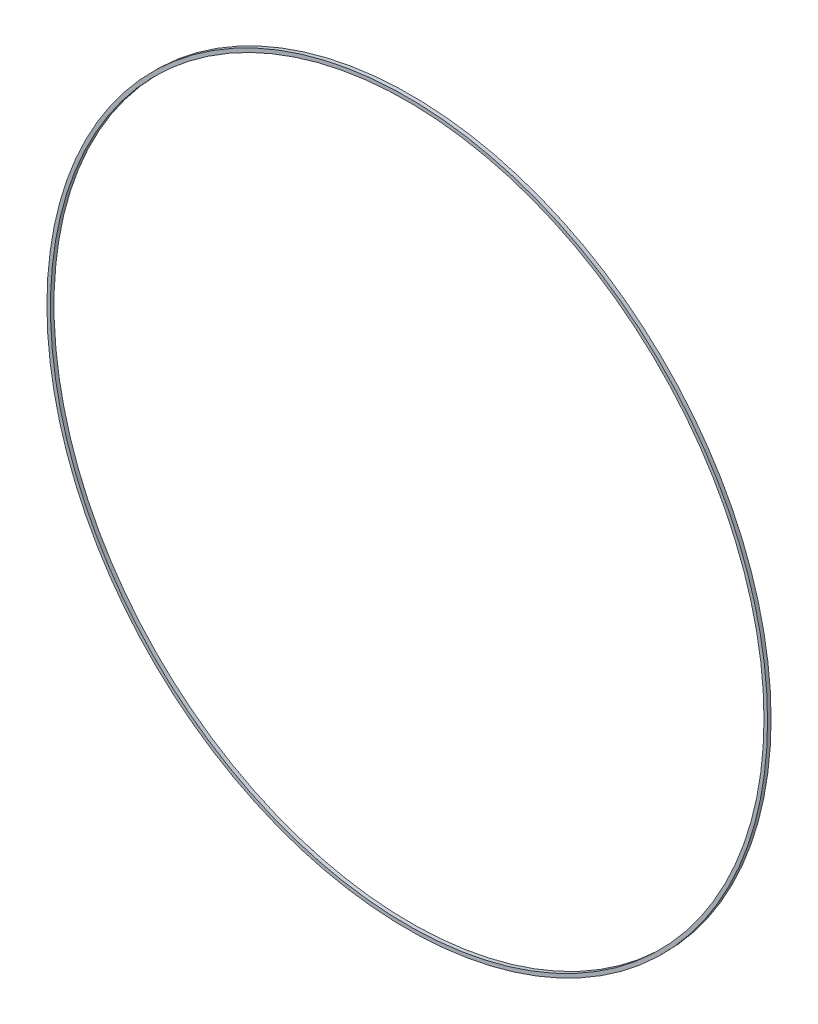
ISO-10303-21;
HEADER;
FILE_DESCRIPTION(('STEP AP214'),'2;1');
FILE_NAME('part.step','',(''),(''),'','','');
FILE_SCHEMA(('AUTOMOTIVE_DESIGN { 1 0 10303 214 1 1 1 1 }'));
ENDSEC;
DATA;
#1=APPLICATION_CONTEXT('core data for automotive mechanical design processes');
#2=APPLICATION_PROTOCOL_DEFINITION('international standard','automotive_design',2000,#1);
#3=PRODUCT_CONTEXT('',#1,'mechanical');
#4=PRODUCT('Part','Part','',(#3));
#5=PRODUCT_RELATED_PRODUCT_CATEGORY('part','',(#4));
#6=PRODUCT_DEFINITION_FORMATION('','',#4);
#7=PRODUCT_DEFINITION_CONTEXT('part definition',#1,'design');
#8=PRODUCT_DEFINITION('design','',#6,#7);
#9=PRODUCT_DEFINITION_SHAPE('','',#8);
#10=(LENGTH_UNIT() NAMED_UNIT(*) SI_UNIT(.MILLI.,.METRE.));
#11=(NAMED_UNIT(*) PLANE_ANGLE_UNIT() SI_UNIT($,.RADIAN.));
#12=(NAMED_UNIT(*) SI_UNIT($,.STERADIAN.) SOLID_ANGLE_UNIT());
#13=UNCERTAINTY_MEASURE_WITH_UNIT(LENGTH_MEASURE(1.E-05),#10,'distance_accuracy_value','');
#14=(GEOMETRIC_REPRESENTATION_CONTEXT(3) GLOBAL_UNCERTAINTY_ASSIGNED_CONTEXT((#13)) GLOBAL_UNIT_ASSIGNED_CONTEXT((#10,
#11,#12)) REPRESENTATION_CONTEXT('',''));
#15=CARTESIAN_POINT('',(0.,0.,0.));
#16=DIRECTION('',(0.,0.,1.));
#17=DIRECTION('',(1.,0.,0.));
#18=AXIS2_PLACEMENT_3D('',#15,#16,#17);
#19=CARTESIAN_POINT('',(0.,0.,2.));
#20=DIRECTION('',(0.,0.,-1.));
#21=DIRECTION('',(-1.,0.,0.));
#22=AXIS2_PLACEMENT_3D('',#19,#20,#21);
#23=CYLINDRICAL_SURFACE('',#22,203.);
#24=CARTESIAN_POINT('',(0.,0.,2.));
#25=DIRECTION('',(0.,0.,1.));
#26=DIRECTION('',(1.,0.,0.));
#27=AXIS2_PLACEMENT_3D('',#24,#25,#26);
#28=CIRCLE('',#27,203.);
#29=CARTESIAN_POINT('',(203.,0.,2.));
#30=VERTEX_POINT('',#29);
#31=EDGE_CURVE('E10',#30,#30,#28,.T.);
#32=ORIENTED_EDGE('',*,*,#31,.F.);
#33=EDGE_LOOP('',(#32));
#34=FACE_BOUND('',#33,.T.);
#35=CARTESIAN_POINT('',(0.,0.,0.));
#36=DIRECTION('',(0.,0.,1.));
#37=DIRECTION('',(1.,0.,0.));
#38=AXIS2_PLACEMENT_3D('',#35,#36,#37);
#39=CIRCLE('',#38,203.);
#40=CARTESIAN_POINT('',(203.,0.,0.));
#41=VERTEX_POINT('',#40);
#42=EDGE_CURVE('E34',#41,#41,#39,.T.);
#43=ORIENTED_EDGE('',*,*,#42,.T.);
#44=EDGE_LOOP('',(#43));
#45=FACE_BOUND('',#44,.T.);
#46=ADVANCED_FACE('F31',(#34,#45),#23,.T.);
#47=CARTESIAN_POINT('',(0.,0.,2.));
#48=DIRECTION('',(0.,0.,1.));
#49=DIRECTION('',(1.,0.,0.));
#50=AXIS2_PLACEMENT_3D('',#47,#48,#49);
#51=PLANE('',#50);
#52=CARTESIAN_POINT('',(0.,0.,2.));
#53=DIRECTION('',(0.,0.,1.));
#54=DIRECTION('',(1.,0.,0.));
#55=AXIS2_PLACEMENT_3D('',#52,#53,#54);
#56=CIRCLE('',#55,201.);
#57=CARTESIAN_POINT('',(201.,0.,2.));
#58=VERTEX_POINT('',#57);
#59=EDGE_CURVE('E43',#58,#58,#56,.T.);
#60=ORIENTED_EDGE('',*,*,#59,.F.);
#61=EDGE_LOOP('',(#60));
#62=FACE_BOUND('',#61,.T.);
#63=ORIENTED_EDGE('',*,*,#31,.T.);
#64=EDGE_LOOP('',(#63));
#65=FACE_BOUND('',#64,.T.);
#66=ADVANCED_FACE('F58',(#62,#65),#51,.T.);
#67=CARTESIAN_POINT('',(0.,0.,0.));
#68=DIRECTION('',(0.,0.,1.));
#69=DIRECTION('',(1.,0.,0.));
#70=AXIS2_PLACEMENT_3D('',#67,#68,#69);
#71=PLANE('',#70);
#72=CARTESIAN_POINT('',(0.,0.,0.));
#73=DIRECTION('',(0.,0.,1.));
#74=DIRECTION('',(1.,0.,0.));
#75=AXIS2_PLACEMENT_3D('',#72,#73,#74);
#76=CIRCLE('',#75,201.);
#77=CARTESIAN_POINT('',(201.,0.,0.));
#78=VERTEX_POINT('',#77);
#79=EDGE_CURVE('E41',#78,#78,#76,.T.);
#80=ORIENTED_EDGE('',*,*,#79,.T.);
#81=EDGE_LOOP('',(#80));
#82=FACE_BOUND('',#81,.T.);
#83=ORIENTED_EDGE('',*,*,#42,.F.);
#84=EDGE_LOOP('',(#83));
#85=FACE_BOUND('',#84,.T.);
#86=ADVANCED_FACE('F49',(#82,#85),#71,.F.);
#87=CARTESIAN_POINT('',(0.,0.,0.));
#88=DIRECTION('',(0.,0.,1.));
#89=DIRECTION('',(1.,0.,0.));
#90=AXIS2_PLACEMENT_3D('',#87,#88,#89);
#91=CYLINDRICAL_SURFACE('',#90,201.);
#92=ORIENTED_EDGE('',*,*,#79,.F.);
#93=EDGE_LOOP('',(#92));
#94=FACE_BOUND('',#93,.T.);
#95=ORIENTED_EDGE('',*,*,#59,.T.);
#96=EDGE_LOOP('',(#95));
#97=FACE_BOUND('',#96,.T.);
#98=ADVANCED_FACE('F52',(#94,#97),#91,.F.);
#99=CLOSED_SHELL('',(#46,#66,#86,#98));
#100=MANIFOLD_SOLID_BREP('B2',#99);
#101=ADVANCED_BREP_SHAPE_REPRESENTATION('',(#18,#100),#14);
#102=SHAPE_DEFINITION_REPRESENTATION(#9,#101);
ENDSEC;
END-ISO-10303-21;
